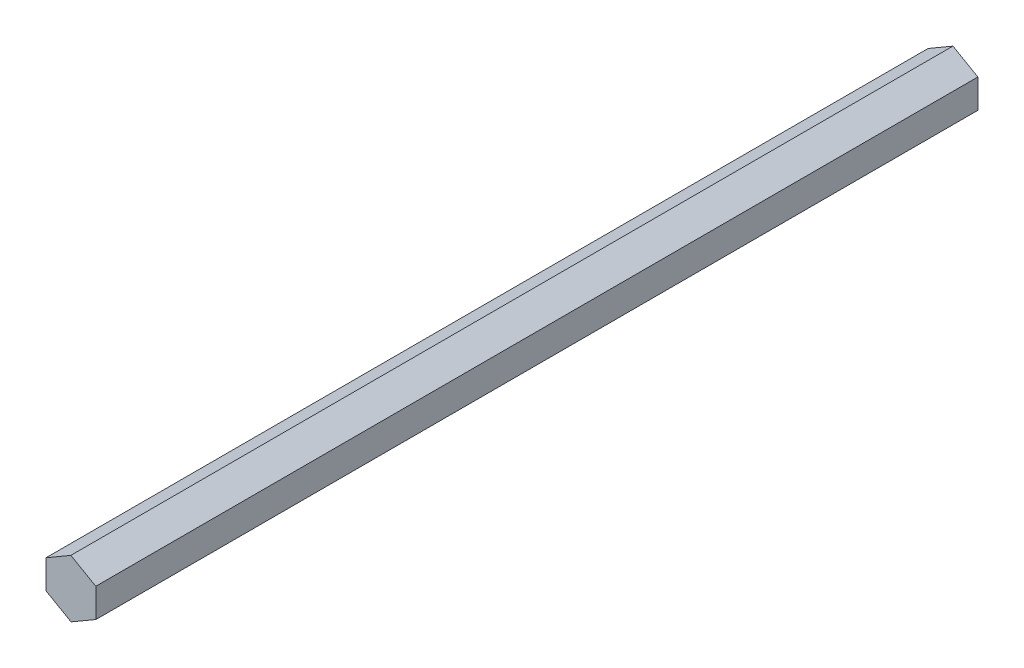
ISO-10303-21;
HEADER;
FILE_DESCRIPTION(('STEP AP214'),'2;1');
FILE_NAME('part.step','',(''),(''),'','','');
FILE_SCHEMA(('AUTOMOTIVE_DESIGN { 1 0 10303 214 1 1 1 1 }'));
ENDSEC;
DATA;
#1=APPLICATION_CONTEXT('core data for automotive mechanical design processes');
#2=APPLICATION_PROTOCOL_DEFINITION('international standard','automotive_design',2000,#1);
#3=PRODUCT_CONTEXT('',#1,'mechanical');
#4=PRODUCT('Part','Part','',(#3));
#5=PRODUCT_RELATED_PRODUCT_CATEGORY('part','',(#4));
#6=PRODUCT_DEFINITION_FORMATION('','',#4);
#7=PRODUCT_DEFINITION_CONTEXT('part definition',#1,'design');
#8=PRODUCT_DEFINITION('design','',#6,#7);
#9=PRODUCT_DEFINITION_SHAPE('','',#8);
#10=(LENGTH_UNIT() NAMED_UNIT(*) SI_UNIT(.MILLI.,.METRE.));
#11=(NAMED_UNIT(*) PLANE_ANGLE_UNIT() SI_UNIT($,.RADIAN.));
#12=(NAMED_UNIT(*) SI_UNIT($,.STERADIAN.) SOLID_ANGLE_UNIT());
#13=UNCERTAINTY_MEASURE_WITH_UNIT(LENGTH_MEASURE(1.E-05),#10,'distance_accuracy_value','');
#14=(GEOMETRIC_REPRESENTATION_CONTEXT(3) GLOBAL_UNCERTAINTY_ASSIGNED_CONTEXT((#13)) GLOBAL_UNIT_ASSIGNED_CONTEXT((#10,
#11,#12)) REPRESENTATION_CONTEXT('',''));
#15=CARTESIAN_POINT('',(0.,0.,0.));
#16=DIRECTION('',(0.,0.,1.));
#17=DIRECTION('',(1.,0.,0.));
#18=AXIS2_PLACEMENT_3D('',#15,#16,#17);
#19=CARTESIAN_POINT('',(6.36607081911575,-3.63819675929385,225.));
#20=DIRECTION('',(-0.999990318597505,-0.00440030808695016,0.));
#21=DIRECTION('',(0.00440030808695016,-0.999990318597505,0.));
#22=AXIS2_PLACEMENT_3D('',#19,#20,#21);
#23=PLANE('',#22);
#24=DIRECTION('',(-0.00440030808695016,0.999990318597505,0.));
#25=VECTOR('',#24,1.);
#26=CARTESIAN_POINT('',(6.36607081911575,-3.63819675929385,0.));
#27=LINE('',#26,#25);
#28=CARTESIAN_POINT('',(6.36607081911575,-3.63819675929385,0.));
#29=VERTEX_POINT('',#28);
#30=CARTESIAN_POINT('',(6.33380622707257,3.69408067199812,0.));
#31=VERTEX_POINT('',#30);
#32=EDGE_CURVE('E124',#29,#31,#27,.T.);
#33=ORIENTED_EDGE('',*,*,#32,.T.);
#34=DIRECTION('',(0.,0.,-1.));
#35=VECTOR('',#34,1.);
#36=CARTESIAN_POINT('',(6.33380622707257,3.69408067199812,225.));
#37=LINE('',#36,#35);
#38=CARTESIAN_POINT('',(6.33380622707257,3.69408067199812,225.));
#39=VERTEX_POINT('',#38);
#40=EDGE_CURVE('E11',#39,#31,#37,.T.);
#41=ORIENTED_EDGE('',*,*,#40,.F.);
#42=DIRECTION('',(-0.00440030808695016,0.999990318597505,0.));
#43=VECTOR('',#42,1.);
#44=CARTESIAN_POINT('',(6.36607081911575,-3.63819675929385,225.));
#45=LINE('',#44,#43);
#46=CARTESIAN_POINT('',(6.36607081911575,-3.63819675929385,225.));
#47=VERTEX_POINT('',#46);
#48=EDGE_CURVE('E134',#47,#39,#45,.T.);
#49=ORIENTED_EDGE('',*,*,#48,.F.);
#50=DIRECTION('',(0.,0.,-1.));
#51=VECTOR('',#50,1.);
#52=CARTESIAN_POINT('',(6.36607081911575,-3.63819675929385,225.));
#53=LINE('',#52,#51);
#54=EDGE_CURVE('E116',#47,#29,#53,.T.);
#55=ORIENTED_EDGE('',*,*,#54,.T.);
#56=EDGE_LOOP('',(#33,#41,#49,#55));
#57=FACE_BOUND('',#56,.T.);
#58=ADVANCED_FACE('F39',(#57),#23,.F.);
#59=CARTESIAN_POINT('',(6.33380622707257,3.69408067199812,225.));
#60=DIRECTION('',(-0.496184380710976,-0.868217173487409,0.));
#61=DIRECTION('',(0.868217173487409,-0.496184380710976,0.));
#62=AXIS2_PLACEMENT_3D('',#59,#60,#61);
#63=PLANE('',#62);
#64=DIRECTION('',(-0.868217173487409,0.496184380710976,0.));
#65=VECTOR('',#64,1.);
#66=CARTESIAN_POINT('',(6.33380622707257,3.69408067199812,0.));
#67=LINE('',#66,#65);
#68=CARTESIAN_POINT('',(-0.0322645920431764,7.33227743129197,0.));
#69=VERTEX_POINT('',#68);
#70=EDGE_CURVE('E127',#31,#69,#67,.T.);
#71=ORIENTED_EDGE('',*,*,#70,.T.);
#72=DIRECTION('',(0.,0.,-1.));
#73=VECTOR('',#72,1.);
#74=CARTESIAN_POINT('',(-0.0322645920431764,7.33227743129197,225.));
#75=LINE('',#74,#73);
#76=CARTESIAN_POINT('',(-0.0322645920431764,7.33227743129197,225.));
#77=VERTEX_POINT('',#76);
#78=EDGE_CURVE('E50',#77,#69,#75,.T.);
#79=ORIENTED_EDGE('',*,*,#78,.F.);
#80=DIRECTION('',(-0.868217173487409,0.496184380710976,0.));
#81=VECTOR('',#80,1.);
#82=CARTESIAN_POINT('',(6.33380622707257,3.69408067199812,225.));
#83=LINE('',#82,#81);
#84=EDGE_CURVE('E95',#39,#77,#83,.T.);
#85=ORIENTED_EDGE('',*,*,#84,.F.);
#86=ORIENTED_EDGE('',*,*,#40,.T.);
#87=EDGE_LOOP('',(#71,#79,#85,#86));
#88=FACE_BOUND('',#87,.T.);
#89=ADVANCED_FACE('F160',(#88),#63,.F.);
#90=CARTESIAN_POINT('',(-0.0322645920431764,7.33227743129197,225.));
#91=DIRECTION('',(0.50380593788653,-0.863816865400459,0.));
#92=DIRECTION('',(0.863816865400459,0.50380593788653,0.));
#93=AXIS2_PLACEMENT_3D('',#90,#91,#92);
#94=PLANE('',#93);
#95=DIRECTION('',(-0.863816865400459,-0.50380593788653,0.));
#96=VECTOR('',#95,1.);
#97=CARTESIAN_POINT('',(-0.0322645920431764,7.33227743129197,0.));
#98=LINE('',#97,#96);
#99=CARTESIAN_POINT('',(-6.36607081911575,3.63819675929385,0.));
#100=VERTEX_POINT('',#99);
#101=EDGE_CURVE('E126',#69,#100,#98,.T.);
#102=ORIENTED_EDGE('',*,*,#101,.T.);
#103=DIRECTION('',(0.,0.,-1.));
#104=VECTOR('',#103,1.);
#105=CARTESIAN_POINT('',(-6.36607081911575,3.63819675929385,225.));
#106=LINE('',#105,#104);
#107=CARTESIAN_POINT('',(-6.36607081911575,3.63819675929385,225.));
#108=VERTEX_POINT('',#107);
#109=EDGE_CURVE('E111',#108,#100,#106,.T.);
#110=ORIENTED_EDGE('',*,*,#109,.F.);
#111=DIRECTION('',(-0.863816865400459,-0.50380593788653,0.));
#112=VECTOR('',#111,1.);
#113=CARTESIAN_POINT('',(-0.0322645920431764,7.33227743129197,225.));
#114=LINE('',#113,#112);
#115=EDGE_CURVE('E104',#77,#108,#114,.T.);
#116=ORIENTED_EDGE('',*,*,#115,.F.);
#117=ORIENTED_EDGE('',*,*,#78,.T.);
#118=EDGE_LOOP('',(#102,#110,#116,#117));
#119=FACE_BOUND('',#118,.T.);
#120=ADVANCED_FACE('F136',(#119),#94,.F.);
#121=CARTESIAN_POINT('',(-6.36607081911575,3.63819675929385,225.));
#122=DIRECTION('',(0.999990318597505,0.00440030808695004,0.));
#123=DIRECTION('',(-0.00440030808695004,0.999990318597505,0.));
#124=AXIS2_PLACEMENT_3D('',#121,#122,#123);
#125=PLANE('',#124);
#126=DIRECTION('',(0.00440030808695004,-0.999990318597505,0.));
#127=VECTOR('',#126,1.);
#128=CARTESIAN_POINT('',(-6.36607081911575,3.63819675929385,0.));
#129=LINE('',#128,#127);
#130=CARTESIAN_POINT('',(-6.33380622707257,-3.69408067199812,0.));
#131=VERTEX_POINT('',#130);
#132=EDGE_CURVE('E114',#100,#131,#129,.T.);
#133=ORIENTED_EDGE('',*,*,#132,.T.);
#134=DIRECTION('',(0.,0.,-1.));
#135=VECTOR('',#134,1.);
#136=CARTESIAN_POINT('',(-6.33380622707257,-3.69408067199812,225.));
#137=LINE('',#136,#135);
#138=CARTESIAN_POINT('',(-6.33380622707257,-3.69408067199812,225.));
#139=VERTEX_POINT('',#138);
#140=EDGE_CURVE('E109',#139,#131,#137,.T.);
#141=ORIENTED_EDGE('',*,*,#140,.F.);
#142=DIRECTION('',(0.00440030808695004,-0.999990318597505,0.));
#143=VECTOR('',#142,1.);
#144=CARTESIAN_POINT('',(-6.36607081911575,3.63819675929385,225.));
#145=LINE('',#144,#143);
#146=EDGE_CURVE('E97',#108,#139,#145,.T.);
#147=ORIENTED_EDGE('',*,*,#146,.F.);
#148=ORIENTED_EDGE('',*,*,#109,.T.);
#149=EDGE_LOOP('',(#133,#141,#147,#148));
#150=FACE_BOUND('',#149,.T.);
#151=ADVANCED_FACE('F112',(#150),#125,.F.);
#152=CARTESIAN_POINT('',(-6.33380622707257,-3.69408067199812,225.));
#153=DIRECTION('',(0.496184380710976,0.868217173487409,0.));
#154=DIRECTION('',(-0.868217173487409,0.496184380710976,0.));
#155=AXIS2_PLACEMENT_3D('',#152,#153,#154);
#156=PLANE('',#155);
#157=DIRECTION('',(0.868217173487409,-0.496184380710976,0.));
#158=VECTOR('',#157,1.);
#159=CARTESIAN_POINT('',(-6.33380622707257,-3.69408067199812,0.));
#160=LINE('',#159,#158);
#161=CARTESIAN_POINT('',(0.0322645920431703,-7.33227743129197,0.));
#162=VERTEX_POINT('',#161);
#163=EDGE_CURVE('E79',#131,#162,#160,.T.);
#164=ORIENTED_EDGE('',*,*,#163,.T.);
#165=DIRECTION('',(0.,0.,-1.));
#166=VECTOR('',#165,1.);
#167=CARTESIAN_POINT('',(0.0322645920431703,-7.33227743129197,225.));
#168=LINE('',#167,#166);
#169=CARTESIAN_POINT('',(0.0322645920431703,-7.33227743129197,225.));
#170=VERTEX_POINT('',#169);
#171=EDGE_CURVE('E113',#170,#162,#168,.T.);
#172=ORIENTED_EDGE('',*,*,#171,.F.);
#173=DIRECTION('',(0.868217173487409,-0.496184380710976,0.));
#174=VECTOR('',#173,1.);
#175=CARTESIAN_POINT('',(-6.33380622707257,-3.69408067199812,225.));
#176=LINE('',#175,#174);
#177=EDGE_CURVE('E103',#139,#170,#176,.T.);
#178=ORIENTED_EDGE('',*,*,#177,.F.);
#179=ORIENTED_EDGE('',*,*,#140,.T.);
#180=EDGE_LOOP('',(#164,#172,#178,#179));
#181=FACE_BOUND('',#180,.T.);
#182=ADVANCED_FACE('F120',(#181),#156,.F.);
#183=CARTESIAN_POINT('',(0.0322645920431703,-7.33227743129197,225.));
#184=DIRECTION('',(-0.503805937886529,0.863816865400459,0.));
#185=DIRECTION('',(-0.863816865400459,-0.503805937886529,0.));
#186=AXIS2_PLACEMENT_3D('',#183,#184,#185);
#187=PLANE('',#186);
#188=DIRECTION('',(0.863816865400459,0.503805937886529,0.));
#189=VECTOR('',#188,1.);
#190=CARTESIAN_POINT('',(0.0322645920431703,-7.33227743129197,0.));
#191=LINE('',#190,#189);
#192=EDGE_CURVE('E81',#162,#29,#191,.T.);
#193=ORIENTED_EDGE('',*,*,#192,.T.);
#194=ORIENTED_EDGE('',*,*,#54,.F.);
#195=DIRECTION('',(0.863816865400459,0.503805937886529,0.));
#196=VECTOR('',#195,1.);
#197=CARTESIAN_POINT('',(0.0322645920431703,-7.33227743129197,225.));
#198=LINE('',#197,#196);
#199=EDGE_CURVE('E54',#170,#47,#198,.T.);
#200=ORIENTED_EDGE('',*,*,#199,.F.);
#201=ORIENTED_EDGE('',*,*,#171,.T.);
#202=EDGE_LOOP('',(#193,#194,#200,#201));
#203=FACE_BOUND('',#202,.T.);
#204=ADVANCED_FACE('F148',(#203),#187,.F.);
#205=CARTESIAN_POINT('',(0.,0.,225.));
#206=DIRECTION('',(0.,0.,1.));
#207=DIRECTION('',(1.,0.,0.));
#208=AXIS2_PLACEMENT_3D('',#205,#206,#207);
#209=PLANE('',#208);
#210=ORIENTED_EDGE('',*,*,#48,.T.);
#211=ORIENTED_EDGE('',*,*,#84,.T.);
#212=ORIENTED_EDGE('',*,*,#115,.T.);
#213=ORIENTED_EDGE('',*,*,#146,.T.);
#214=ORIENTED_EDGE('',*,*,#177,.T.);
#215=ORIENTED_EDGE('',*,*,#199,.T.);
#216=EDGE_LOOP('',(#210,#211,#212,#213,#214,#215));
#217=FACE_BOUND('',#216,.T.);
#218=ADVANCED_FACE('F101',(#217),#209,.T.);
#219=CARTESIAN_POINT('',(0.,0.,0.));
#220=DIRECTION('',(0.,0.,1.));
#221=DIRECTION('',(1.,0.,0.));
#222=AXIS2_PLACEMENT_3D('',#219,#220,#221);
#223=PLANE('',#222);
#224=ORIENTED_EDGE('',*,*,#32,.F.);
#225=ORIENTED_EDGE('',*,*,#192,.F.);
#226=ORIENTED_EDGE('',*,*,#163,.F.);
#227=ORIENTED_EDGE('',*,*,#132,.F.);
#228=ORIENTED_EDGE('',*,*,#101,.F.);
#229=ORIENTED_EDGE('',*,*,#70,.F.);
#230=EDGE_LOOP('',(#224,#225,#226,#227,#228,#229));
#231=FACE_BOUND('',#230,.T.);
#232=ADVANCED_FACE('F142',(#231),#223,.F.);
#233=CLOSED_SHELL('',(#58,#89,#120,#151,#182,#204,#218,#232));
#234=MANIFOLD_SOLID_BREP('B2',#233);
#235=ADVANCED_BREP_SHAPE_REPRESENTATION('',(#18,#234),#14);
#236=SHAPE_DEFINITION_REPRESENTATION(#9,#235);
ENDSEC;
END-ISO-10303-21;
